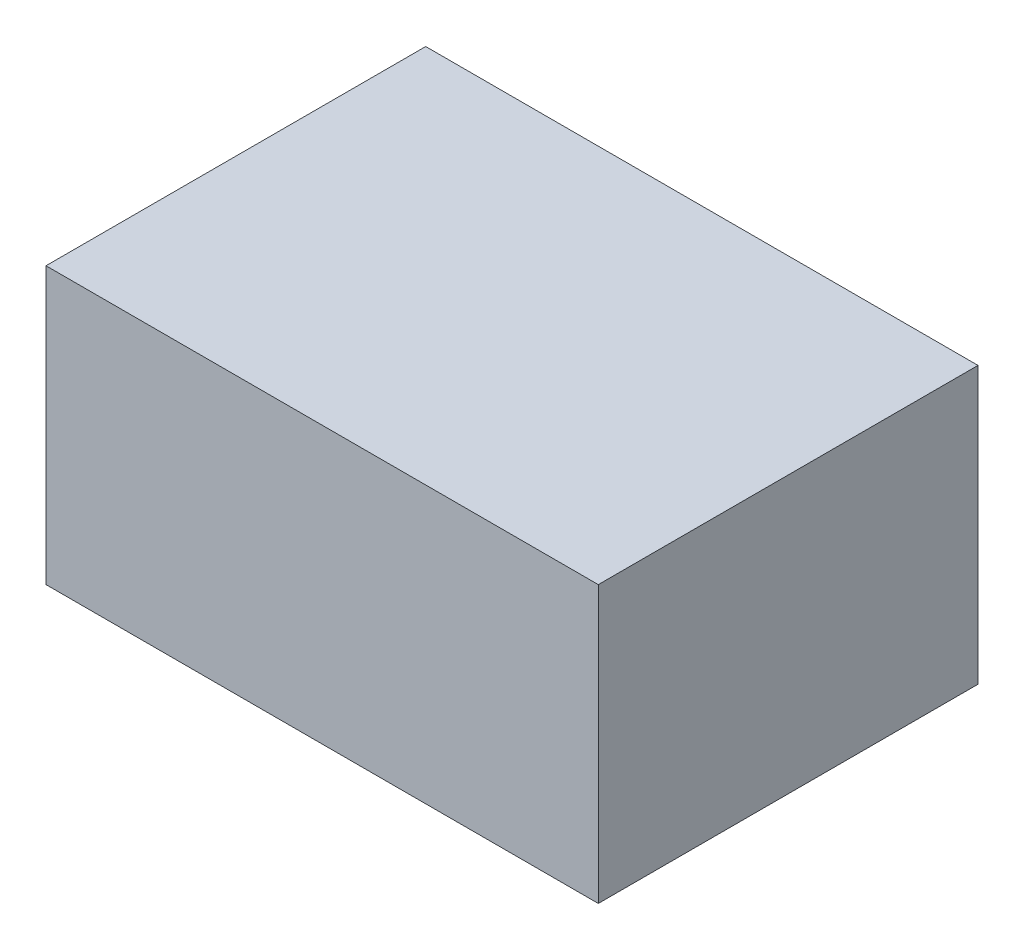
ISO-10303-21;
HEADER;
FILE_DESCRIPTION(('STEP AP214'),'2;1');
FILE_NAME('part.step','',(''),(''),'','','');
FILE_SCHEMA(('AUTOMOTIVE_DESIGN { 1 0 10303 214 1 1 1 1 }'));
ENDSEC;
DATA;
#1=APPLICATION_CONTEXT('core data for automotive mechanical design processes');
#2=APPLICATION_PROTOCOL_DEFINITION('international standard','automotive_design',2000,#1);
#3=PRODUCT_CONTEXT('',#1,'mechanical');
#4=PRODUCT('Part','Part','',(#3));
#5=PRODUCT_RELATED_PRODUCT_CATEGORY('part','',(#4));
#6=PRODUCT_DEFINITION_FORMATION('','',#4);
#7=PRODUCT_DEFINITION_CONTEXT('part definition',#1,'design');
#8=PRODUCT_DEFINITION('design','',#6,#7);
#9=PRODUCT_DEFINITION_SHAPE('','',#8);
#10=(LENGTH_UNIT() NAMED_UNIT(*) SI_UNIT(.MILLI.,.METRE.));
#11=(NAMED_UNIT(*) PLANE_ANGLE_UNIT() SI_UNIT($,.RADIAN.));
#12=(NAMED_UNIT(*) SI_UNIT($,.STERADIAN.) SOLID_ANGLE_UNIT());
#13=UNCERTAINTY_MEASURE_WITH_UNIT(LENGTH_MEASURE(1.E-05),#10,'distance_accuracy_value','');
#14=(GEOMETRIC_REPRESENTATION_CONTEXT(3) GLOBAL_UNCERTAINTY_ASSIGNED_CONTEXT((#13)) GLOBAL_UNIT_ASSIGNED_CONTEXT((#10,
#11,#12)) REPRESENTATION_CONTEXT('',''));
#15=CARTESIAN_POINT('',(0.,0.,0.));
#16=DIRECTION('',(0.,0.,1.));
#17=DIRECTION('',(1.,0.,0.));
#18=AXIS2_PLACEMENT_3D('',#15,#16,#17);
#19=CARTESIAN_POINT('',(0.3999992,0.1999996,0.));
#20=DIRECTION('',(0.,-1.,0.));
#21=DIRECTION('',(0.,0.,-1.));
#22=AXIS2_PLACEMENT_3D('',#19,#20,#21);
#23=PLANE('',#22);
#24=DIRECTION('',(0.,0.,-1.));
#25=VECTOR('',#24,1.);
#26=CARTESIAN_POINT('',(-0.3999992,0.1999996,0.));
#27=LINE('',#26,#25);
#28=CARTESIAN_POINT('',(-0.3999992,0.1999996,0.));
#29=VERTEX_POINT('',#28);
#30=CARTESIAN_POINT('',(-0.3999992,0.1999996,0.5499989));
#31=VERTEX_POINT('',#30);
#32=EDGE_CURVE('E20',#29,#31,#27,.F.);
#33=ORIENTED_EDGE('',*,*,#32,.T.);
#34=DIRECTION('',(-1.,0.,0.));
#35=VECTOR('',#34,1.);
#36=CARTESIAN_POINT('',(-0.3999992,0.1999996,0.5499989));
#37=LINE('',#36,#35);
#38=CARTESIAN_POINT('',(0.3999992,0.1999996,0.5499989));
#39=VERTEX_POINT('',#38);
#40=EDGE_CURVE('E55',#31,#39,#37,.F.);
#41=ORIENTED_EDGE('',*,*,#40,.T.);
#42=DIRECTION('',(0.,0.,1.));
#43=VECTOR('',#42,1.);
#44=CARTESIAN_POINT('',(0.3999992,0.1999996,0.));
#45=LINE('',#44,#43);
#46=CARTESIAN_POINT('',(0.3999992,0.1999996,0.));
#47=VERTEX_POINT('',#46);
#48=EDGE_CURVE('E76',#39,#47,#45,.F.);
#49=ORIENTED_EDGE('',*,*,#48,.T.);
#50=DIRECTION('',(-1.,0.,0.));
#51=VECTOR('',#50,1.);
#52=CARTESIAN_POINT('',(-0.3999992,0.1999996,0.));
#53=LINE('',#52,#51);
#54=EDGE_CURVE('E58',#29,#47,#53,.F.);
#55=ORIENTED_EDGE('',*,*,#54,.F.);
#56=EDGE_LOOP('',(#33,#41,#49,#55));
#57=FACE_BOUND('',#56,.T.);
#58=ADVANCED_FACE('F17',(#57),#23,.F.);
#59=CARTESIAN_POINT('',(-0.3999992,0.1999996,0.));
#60=DIRECTION('',(1.,0.,0.));
#61=DIRECTION('',(0.,0.,-1.));
#62=AXIS2_PLACEMENT_3D('',#59,#60,#61);
#63=PLANE('',#62);
#64=DIRECTION('',(0.,0.,1.));
#65=VECTOR('',#64,1.);
#66=CARTESIAN_POINT('',(-0.3999992,-0.1999996,0.));
#67=LINE('',#66,#65);
#68=CARTESIAN_POINT('',(-0.3999992,-0.1999996,0.));
#69=VERTEX_POINT('',#68);
#70=CARTESIAN_POINT('',(-0.3999992,-0.1999996,0.5499989));
#71=VERTEX_POINT('',#70);
#72=EDGE_CURVE('E73',#69,#71,#67,.T.);
#73=ORIENTED_EDGE('',*,*,#72,.T.);
#74=DIRECTION('',(0.,1.,0.));
#75=VECTOR('',#74,1.);
#76=CARTESIAN_POINT('',(-0.3999992,-0.1999996,0.5499989));
#77=LINE('',#76,#75);
#78=EDGE_CURVE('E63',#71,#31,#77,.T.);
#79=ORIENTED_EDGE('',*,*,#78,.T.);
#80=ORIENTED_EDGE('',*,*,#32,.F.);
#81=DIRECTION('',(0.,1.,0.));
#82=VECTOR('',#81,1.);
#83=CARTESIAN_POINT('',(-0.3999992,-0.1999996,0.));
#84=LINE('',#83,#82);
#85=EDGE_CURVE('E78',#69,#29,#84,.T.);
#86=ORIENTED_EDGE('',*,*,#85,.F.);
#87=EDGE_LOOP('',(#73,#79,#80,#86));
#88=FACE_BOUND('',#87,.T.);
#89=ADVANCED_FACE('F72',(#88),#63,.F.);
#90=CARTESIAN_POINT('',(-0.3999992,-0.1999996,0.5499989));
#91=DIRECTION('',(0.,0.,-1.));
#92=DIRECTION('',(-1.,0.,0.));
#93=AXIS2_PLACEMENT_3D('',#90,#91,#92);
#94=PLANE('',#93);
#95=DIRECTION('',(0.,1.,0.));
#96=VECTOR('',#95,1.);
#97=CARTESIAN_POINT('',(0.3999992,-0.1999996,0.5499989));
#98=LINE('',#97,#96);
#99=CARTESIAN_POINT('',(0.3999992,-0.1999996,0.5499989));
#100=VERTEX_POINT('',#99);
#101=EDGE_CURVE('E69',#100,#39,#98,.T.);
#102=ORIENTED_EDGE('',*,*,#101,.T.);
#103=ORIENTED_EDGE('',*,*,#40,.F.);
#104=ORIENTED_EDGE('',*,*,#78,.F.);
#105=DIRECTION('',(1.,0.,0.));
#106=VECTOR('',#105,1.);
#107=CARTESIAN_POINT('',(-0.3999992,-0.1999996,0.5499989));
#108=LINE('',#107,#106);
#109=EDGE_CURVE('E83',#71,#100,#108,.T.);
#110=ORIENTED_EDGE('',*,*,#109,.T.);
#111=EDGE_LOOP('',(#102,#103,#104,#110));
#112=FACE_BOUND('',#111,.T.);
#113=ADVANCED_FACE('F66',(#112),#94,.F.);
#114=CARTESIAN_POINT('',(0.3999992,-0.1999996,0.));
#115=DIRECTION('',(-1.,0.,0.));
#116=DIRECTION('',(0.,0.,1.));
#117=AXIS2_PLACEMENT_3D('',#114,#115,#116);
#118=PLANE('',#117);
#119=ORIENTED_EDGE('',*,*,#48,.F.);
#120=ORIENTED_EDGE('',*,*,#101,.F.);
#121=DIRECTION('',(0.,0.,1.));
#122=VECTOR('',#121,1.);
#123=CARTESIAN_POINT('',(0.3999992,-0.1999996,0.));
#124=LINE('',#123,#122);
#125=CARTESIAN_POINT('',(0.3999992,-0.1999996,0.));
#126=VERTEX_POINT('',#125);
#127=EDGE_CURVE('E26',#100,#126,#124,.F.);
#128=ORIENTED_EDGE('',*,*,#127,.T.);
#129=DIRECTION('',(0.,1.,0.));
#130=VECTOR('',#129,1.);
#131=CARTESIAN_POINT('',(0.3999992,-0.1999996,0.));
#132=LINE('',#131,#130);
#133=EDGE_CURVE('E34',#47,#126,#132,.F.);
#134=ORIENTED_EDGE('',*,*,#133,.F.);
#135=EDGE_LOOP('',(#119,#120,#128,#134));
#136=FACE_BOUND('',#135,.T.);
#137=ADVANCED_FACE('F88',(#136),#118,.F.);
#138=CARTESIAN_POINT('',(-0.3999992,-0.1999996,0.));
#139=DIRECTION('',(0.,0.,-1.));
#140=DIRECTION('',(-1.,0.,0.));
#141=AXIS2_PLACEMENT_3D('',#138,#139,#140);
#142=PLANE('',#141);
#143=ORIENTED_EDGE('',*,*,#133,.T.);
#144=DIRECTION('',(1.,0.,0.));
#145=VECTOR('',#144,1.);
#146=CARTESIAN_POINT('',(-0.3999992,-0.1999996,0.));
#147=LINE('',#146,#145);
#148=EDGE_CURVE('E11',#126,#69,#147,.F.);
#149=ORIENTED_EDGE('',*,*,#148,.T.);
#150=ORIENTED_EDGE('',*,*,#85,.T.);
#151=ORIENTED_EDGE('',*,*,#54,.T.);
#152=EDGE_LOOP('',(#143,#149,#150,#151));
#153=FACE_BOUND('',#152,.T.);
#154=ADVANCED_FACE('F91',(#153),#142,.T.);
#155=CARTESIAN_POINT('',(-0.3999992,-0.1999996,0.));
#156=DIRECTION('',(0.,1.,0.));
#157=DIRECTION('',(0.,0.,1.));
#158=AXIS2_PLACEMENT_3D('',#155,#156,#157);
#159=PLANE('',#158);
#160=ORIENTED_EDGE('',*,*,#127,.F.);
#161=ORIENTED_EDGE('',*,*,#109,.F.);
#162=ORIENTED_EDGE('',*,*,#72,.F.);
#163=ORIENTED_EDGE('',*,*,#148,.F.);
#164=EDGE_LOOP('',(#160,#161,#162,#163));
#165=FACE_BOUND('',#164,.T.);
#166=ADVANCED_FACE('F90',(#165),#159,.F.);
#167=CLOSED_SHELL('',(#58,#89,#113,#137,#154,#166));
#168=MANIFOLD_SOLID_BREP('B1',#167);
#169=ADVANCED_BREP_SHAPE_REPRESENTATION('',(#18,#168),#14);
#170=SHAPE_DEFINITION_REPRESENTATION(#9,#169);
ENDSEC;
END-ISO-10303-21;
